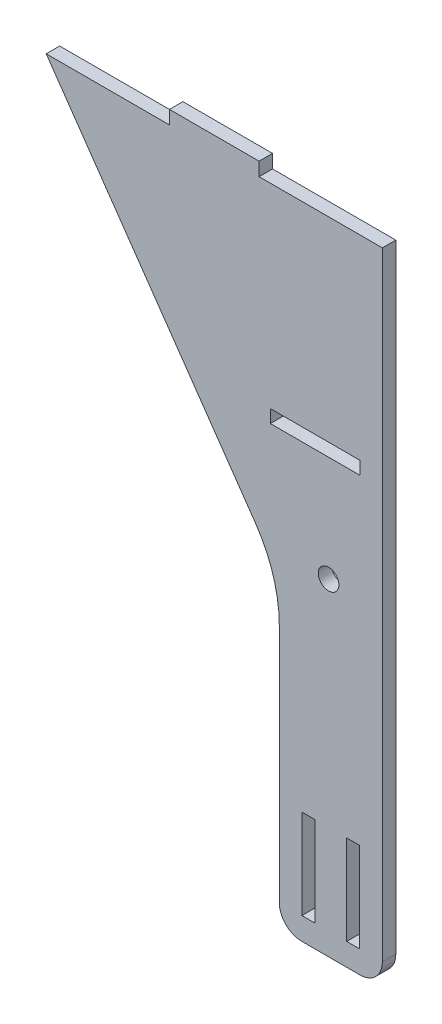
ISO-10303-21;
HEADER;
FILE_DESCRIPTION(('STEP AP214'),'2;1');
FILE_NAME('part.step','',(''),(''),'','','');
FILE_SCHEMA(('AUTOMOTIVE_DESIGN { 1 0 10303 214 1 1 1 1 }'));
ENDSEC;
DATA;
#1=APPLICATION_CONTEXT('core data for automotive mechanical design processes');
#2=APPLICATION_PROTOCOL_DEFINITION('international standard','automotive_design',2000,#1);
#3=PRODUCT_CONTEXT('',#1,'mechanical');
#4=PRODUCT('Part','Part','',(#3));
#5=PRODUCT_RELATED_PRODUCT_CATEGORY('part','',(#4));
#6=PRODUCT_DEFINITION_FORMATION('','',#4);
#7=PRODUCT_DEFINITION_CONTEXT('part definition',#1,'design');
#8=PRODUCT_DEFINITION('design','',#6,#7);
#9=PRODUCT_DEFINITION_SHAPE('','',#8);
#10=(LENGTH_UNIT() NAMED_UNIT(*) SI_UNIT(.MILLI.,.METRE.));
#11=(NAMED_UNIT(*) PLANE_ANGLE_UNIT() SI_UNIT($,.RADIAN.));
#12=(NAMED_UNIT(*) SI_UNIT($,.STERADIAN.) SOLID_ANGLE_UNIT());
#13=UNCERTAINTY_MEASURE_WITH_UNIT(LENGTH_MEASURE(1.E-05),#10,'distance_accuracy_value','');
#14=(GEOMETRIC_REPRESENTATION_CONTEXT(3) GLOBAL_UNCERTAINTY_ASSIGNED_CONTEXT((#13)) GLOBAL_UNIT_ASSIGNED_CONTEXT((#10,
#11,#12)) REPRESENTATION_CONTEXT('',''));
#15=CARTESIAN_POINT('',(0.,0.,0.));
#16=DIRECTION('',(0.,0.,1.));
#17=DIRECTION('',(1.,0.,0.));
#18=AXIS2_PLACEMENT_3D('',#15,#16,#17);
#19=CARTESIAN_POINT('',(0.,0.,3.));
#20=DIRECTION('',(0.,0.,1.));
#21=DIRECTION('',(1.,0.,0.));
#22=AXIS2_PLACEMENT_3D('',#19,#20,#21);
#23=PLANE('',#22);
#24=DIRECTION('',(0.,-1.,0.));
#25=VECTOR('',#24,1.);
#26=CARTESIAN_POINT('',(-5.,99.45,3.));
#27=LINE('',#26,#25);
#28=CARTESIAN_POINT('',(-5.,99.45,3.));
#29=VERTEX_POINT('',#28);
#30=CARTESIAN_POINT('',(-5.,96.55,3.));
#31=VERTEX_POINT('',#30);
#32=EDGE_CURVE('E195',#29,#31,#27,.T.);
#33=ORIENTED_EDGE('',*,*,#32,.T.);
#34=DIRECTION('',(-1.,0.,0.));
#35=VECTOR('',#34,1.);
#36=CARTESIAN_POINT('',(-5.,96.55,3.));
#37=LINE('',#36,#35);
#38=CARTESIAN_POINT('',(-25.,96.55,3.));
#39=VERTEX_POINT('',#38);
#40=EDGE_CURVE('E204',#31,#39,#37,.T.);
#41=ORIENTED_EDGE('',*,*,#40,.T.);
#42=DIRECTION('',(0.,1.,0.));
#43=VECTOR('',#42,1.);
#44=CARTESIAN_POINT('',(-25.,99.45,3.));
#45=LINE('',#44,#43);
#46=CARTESIAN_POINT('',(-25.,99.45,3.));
#47=VERTEX_POINT('',#46);
#48=EDGE_CURVE('E48',#39,#47,#45,.T.);
#49=ORIENTED_EDGE('',*,*,#48,.T.);
#50=DIRECTION('',(1.,0.,0.));
#51=VECTOR('',#50,1.);
#52=CARTESIAN_POINT('',(-5.,99.45,3.));
#53=LINE('',#52,#51);
#54=EDGE_CURVE('E201',#47,#29,#53,.T.);
#55=ORIENTED_EDGE('',*,*,#54,.T.);
#56=EDGE_LOOP('',(#33,#41,#49,#55));
#57=FACE_BOUND('',#56,.T.);
#58=CARTESIAN_POINT('',(-12.0000000000026,73.,3.));
#59=DIRECTION('',(0.,0.,1.));
#60=DIRECTION('',(1.,0.,0.));
#61=AXIS2_PLACEMENT_3D('',#58,#59,#60);
#62=CIRCLE('',#61,2.3);
#63=CARTESIAN_POINT('',(-9.70000000000261,73.,3.));
#64=VERTEX_POINT('',#63);
#65=EDGE_CURVE('E225',#64,#64,#62,.T.);
#66=ORIENTED_EDGE('',*,*,#65,.F.);
#67=EDGE_LOOP('',(#66));
#68=FACE_BOUND('',#67,.T.);
#69=DIRECTION('',(1.,0.,0.));
#70=VECTOR('',#69,1.);
#71=CARTESIAN_POINT('',(-17.95,4.99999999999994,3.));
#72=LINE('',#71,#70);
#73=CARTESIAN_POINT('',(-17.95,4.99999999999994,3.));
#74=VERTEX_POINT('',#73);
#75=CARTESIAN_POINT('',(-15.05,4.99999999999994,3.));
#76=VERTEX_POINT('',#75);
#77=EDGE_CURVE('E265',#74,#76,#72,.T.);
#78=ORIENTED_EDGE('',*,*,#77,.F.);
#79=DIRECTION('',(0.,-1.,0.));
#80=VECTOR('',#79,1.);
#81=CARTESIAN_POINT('',(-17.95,24.9999999999999,3.));
#82=LINE('',#81,#80);
#83=CARTESIAN_POINT('',(-17.95,24.9999999999999,3.));
#84=VERTEX_POINT('',#83);
#85=EDGE_CURVE('E263',#84,#74,#82,.T.);
#86=ORIENTED_EDGE('',*,*,#85,.F.);
#87=DIRECTION('',(-1.,0.,0.));
#88=VECTOR('',#87,1.);
#89=CARTESIAN_POINT('',(-17.95,24.9999999999999,3.));
#90=LINE('',#89,#88);
#91=CARTESIAN_POINT('',(-15.05,24.9999999999999,3.));
#92=VERTEX_POINT('',#91);
#93=EDGE_CURVE('E271',#92,#84,#90,.T.);
#94=ORIENTED_EDGE('',*,*,#93,.F.);
#95=DIRECTION('',(0.,1.,0.));
#96=VECTOR('',#95,1.);
#97=CARTESIAN_POINT('',(-15.05,24.9999999999999,3.));
#98=LINE('',#97,#96);
#99=EDGE_CURVE('E268',#76,#92,#98,.T.);
#100=ORIENTED_EDGE('',*,*,#99,.F.);
#101=EDGE_LOOP('',(#78,#86,#94,#100));
#102=FACE_BOUND('',#101,.T.);
#103=DIRECTION('',(1.,0.,0.));
#104=VECTOR('',#103,1.);
#105=CARTESIAN_POINT('',(0.,0.,3.));
#106=LINE('',#105,#104);
#107=CARTESIAN_POINT('',(-18.,0.,3.));
#108=VERTEX_POINT('',#107);
#109=CARTESIAN_POINT('',(-5.,0.,3.));
#110=VERTEX_POINT('',#109);
#111=EDGE_CURVE('E312',#108,#110,#106,.T.);
#112=ORIENTED_EDGE('',*,*,#111,.T.);
#113=CARTESIAN_POINT('',(-5.,5.,3.));
#114=DIRECTION('',(0.,0.,1.));
#115=DIRECTION('',(1.,0.,0.));
#116=AXIS2_PLACEMENT_3D('',#113,#114,#115);
#117=CIRCLE('',#116,5.);
#118=CARTESIAN_POINT('',(0.,5.,3.));
#119=VERTEX_POINT('',#118);
#120=EDGE_CURVE('E366',#110,#119,#117,.T.);
#121=ORIENTED_EDGE('',*,*,#120,.T.);
#122=DIRECTION('',(0.,1.,0.));
#123=VECTOR('',#122,1.);
#124=CARTESIAN_POINT('',(0.,0.,3.));
#125=LINE('',#124,#123);
#126=CARTESIAN_POINT('',(0.,143.,3.));
#127=VERTEX_POINT('',#126);
#128=EDGE_CURVE('E294',#119,#127,#125,.T.);
#129=ORIENTED_EDGE('',*,*,#128,.T.);
#130=DIRECTION('',(-1.,0.,0.));
#131=VECTOR('',#130,1.);
#132=CARTESIAN_POINT('',(0.,143.,3.));
#133=LINE('',#132,#131);
#134=CARTESIAN_POINT('',(-27.5,143.,3.));
#135=VERTEX_POINT('',#134);
#136=EDGE_CURVE('E296',#127,#135,#133,.T.);
#137=ORIENTED_EDGE('',*,*,#136,.T.);
#138=DIRECTION('',(0.,1.,0.));
#139=VECTOR('',#138,1.);
#140=CARTESIAN_POINT('',(-27.5,143.,3.));
#141=LINE('',#140,#139);
#142=CARTESIAN_POINT('',(-27.5,146.,3.));
#143=VERTEX_POINT('',#142);
#144=EDGE_CURVE('E299',#135,#143,#141,.T.);
#145=ORIENTED_EDGE('',*,*,#144,.T.);
#146=DIRECTION('',(-1.,0.,0.));
#147=VECTOR('',#146,1.);
#148=CARTESIAN_POINT('',(-47.5,146.,3.));
#149=LINE('',#148,#147);
#150=CARTESIAN_POINT('',(-47.5,146.,3.));
#151=VERTEX_POINT('',#150);
#152=EDGE_CURVE('E301',#143,#151,#149,.T.);
#153=ORIENTED_EDGE('',*,*,#152,.T.);
#154=DIRECTION('',(0.,-1.,0.));
#155=VECTOR('',#154,1.);
#156=CARTESIAN_POINT('',(-47.5,143.,3.));
#157=LINE('',#156,#155);
#158=CARTESIAN_POINT('',(-47.5,143.,3.));
#159=VERTEX_POINT('',#158);
#160=EDGE_CURVE('E303',#151,#159,#157,.T.);
#161=ORIENTED_EDGE('',*,*,#160,.T.);
#162=DIRECTION('',(-1.,0.,0.));
#163=VECTOR('',#162,1.);
#164=CARTESIAN_POINT('',(-75.,143.,3.));
#165=LINE('',#164,#163);
#166=CARTESIAN_POINT('',(-75.,143.,3.));
#167=VERTEX_POINT('',#166);
#168=EDGE_CURVE('E305',#159,#167,#165,.T.);
#169=ORIENTED_EDGE('',*,*,#168,.T.);
#170=DIRECTION('',(0.569779621770593,-0.821797531399894,0.));
#171=VECTOR('',#170,1.);
#172=CARTESIAN_POINT('',(-23.,68.,3.));
#173=LINE('',#172,#171);
#174=CARTESIAN_POINT('',(-28.3460740580032,75.7106837375046,3.));
#175=VERTEX_POINT('',#174);
#176=EDGE_CURVE('E307',#167,#175,#173,.T.);
#177=ORIENTED_EDGE('',*,*,#176,.T.);
#178=CARTESIAN_POINT('',(-53.,58.6172950843868,3.));
#179=DIRECTION('',(0.,0.,1.));
#180=DIRECTION('',(1.,0.,0.));
#181=AXIS2_PLACEMENT_3D('',#178,#179,#180);
#182=CIRCLE('',#181,30.);
#183=CARTESIAN_POINT('',(-23.,58.6172950843868,3.));
#184=VERTEX_POINT('',#183);
#185=EDGE_CURVE('E11',#175,#184,#182,.F.);
#186=ORIENTED_EDGE('',*,*,#185,.T.);
#187=DIRECTION('',(0.,-1.,0.));
#188=VECTOR('',#187,1.);
#189=CARTESIAN_POINT('',(-23.,0.,3.));
#190=LINE('',#189,#188);
#191=CARTESIAN_POINT('',(-23.,5.,3.));
#192=VERTEX_POINT('',#191);
#193=EDGE_CURVE('E310',#184,#192,#190,.T.);
#194=ORIENTED_EDGE('',*,*,#193,.T.);
#195=CARTESIAN_POINT('',(-18.,5.,3.));
#196=DIRECTION('',(0.,0.,1.));
#197=DIRECTION('',(1.,0.,0.));
#198=AXIS2_PLACEMENT_3D('',#195,#196,#197);
#199=CIRCLE('',#198,5.);
#200=EDGE_CURVE('E364',#192,#108,#199,.T.);
#201=ORIENTED_EDGE('',*,*,#200,.T.);
#202=EDGE_LOOP('',(#112,#121,#129,#137,#145,#153,#161,#169,#177,#186,#194,#201));
#203=FACE_BOUND('',#202,.T.);
#204=DIRECTION('',(1.,0.,0.));
#205=VECTOR('',#204,1.);
#206=CARTESIAN_POINT('',(-7.94999999999999,4.99999999999994,3.));
#207=LINE('',#206,#205);
#208=CARTESIAN_POINT('',(-7.94999999999999,4.99999999999994,3.));
#209=VERTEX_POINT('',#208);
#210=CARTESIAN_POINT('',(-5.04999999999999,4.99999999999994,3.));
#211=VERTEX_POINT('',#210);
#212=EDGE_CURVE('E233',#209,#211,#207,.T.);
#213=ORIENTED_EDGE('',*,*,#212,.F.);
#214=DIRECTION('',(0.,-1.,0.));
#215=VECTOR('',#214,1.);
#216=CARTESIAN_POINT('',(-7.94999999999999,4.99999999999994,3.));
#217=LINE('',#216,#215);
#218=CARTESIAN_POINT('',(-7.94999999999999,24.9999999999999,3.));
#219=VERTEX_POINT('',#218);
#220=EDGE_CURVE('E231',#219,#209,#217,.T.);
#221=ORIENTED_EDGE('',*,*,#220,.F.);
#222=DIRECTION('',(-1.,0.,0.));
#223=VECTOR('',#222,1.);
#224=CARTESIAN_POINT('',(-7.94999999999999,24.9999999999999,3.));
#225=LINE('',#224,#223);
#226=CARTESIAN_POINT('',(-5.05,24.9999999999999,3.));
#227=VERTEX_POINT('',#226);
#228=EDGE_CURVE('E239',#227,#219,#225,.T.);
#229=ORIENTED_EDGE('',*,*,#228,.F.);
#230=DIRECTION('',(0.,1.,0.));
#231=VECTOR('',#230,1.);
#232=CARTESIAN_POINT('',(-5.04999999999999,4.99999999999994,3.));
#233=LINE('',#232,#231);
#234=EDGE_CURVE('E236',#211,#227,#233,.T.);
#235=ORIENTED_EDGE('',*,*,#234,.F.);
#236=EDGE_LOOP('',(#213,#221,#229,#235));
#237=FACE_BOUND('',#236,.T.);
#238=ADVANCED_FACE('F32',(#57,#68,#102,#203,#237),#23,.T.);
#239=CARTESIAN_POINT('',(0.,0.,0.));
#240=DIRECTION('',(0.,0.,1.));
#241=DIRECTION('',(1.,0.,0.));
#242=AXIS2_PLACEMENT_3D('',#239,#240,#241);
#243=PLANE('',#242);
#244=DIRECTION('',(-1.,0.,0.));
#245=VECTOR('',#244,1.);
#246=CARTESIAN_POINT('',(-5.,96.55,0.));
#247=LINE('',#246,#245);
#248=CARTESIAN_POINT('',(-5.,96.55,0.));
#249=VERTEX_POINT('',#248);
#250=CARTESIAN_POINT('',(-25.,96.55,0.));
#251=VERTEX_POINT('',#250);
#252=EDGE_CURVE('E219',#249,#251,#247,.T.);
#253=ORIENTED_EDGE('',*,*,#252,.F.);
#254=DIRECTION('',(0.,-1.,0.));
#255=VECTOR('',#254,1.);
#256=CARTESIAN_POINT('',(-5.,99.45,0.));
#257=LINE('',#256,#255);
#258=CARTESIAN_POINT('',(-5.,99.45,0.));
#259=VERTEX_POINT('',#258);
#260=EDGE_CURVE('E56',#259,#249,#257,.T.);
#261=ORIENTED_EDGE('',*,*,#260,.F.);
#262=DIRECTION('',(1.,0.,0.));
#263=VECTOR('',#262,1.);
#264=CARTESIAN_POINT('',(-5.,99.45,0.));
#265=LINE('',#264,#263);
#266=CARTESIAN_POINT('',(-25.,99.45,0.));
#267=VERTEX_POINT('',#266);
#268=EDGE_CURVE('E210',#267,#259,#265,.T.);
#269=ORIENTED_EDGE('',*,*,#268,.F.);
#270=DIRECTION('',(0.,1.,0.));
#271=VECTOR('',#270,1.);
#272=CARTESIAN_POINT('',(-25.,99.45,0.));
#273=LINE('',#272,#271);
#274=EDGE_CURVE('E213',#251,#267,#273,.T.);
#275=ORIENTED_EDGE('',*,*,#274,.F.);
#276=EDGE_LOOP('',(#253,#261,#269,#275));
#277=FACE_BOUND('',#276,.T.);
#278=CARTESIAN_POINT('',(-12.0000000000026,73.,0.));
#279=DIRECTION('',(0.,0.,1.));
#280=DIRECTION('',(1.,0.,0.));
#281=AXIS2_PLACEMENT_3D('',#278,#279,#280);
#282=CIRCLE('',#281,2.3);
#283=CARTESIAN_POINT('',(-9.70000000000261,73.,0.));
#284=VERTEX_POINT('',#283);
#285=EDGE_CURVE('E36',#284,#284,#282,.T.);
#286=ORIENTED_EDGE('',*,*,#285,.T.);
#287=EDGE_LOOP('',(#286));
#288=FACE_BOUND('',#287,.T.);
#289=DIRECTION('',(0.,-1.,0.));
#290=VECTOR('',#289,1.);
#291=CARTESIAN_POINT('',(-17.95,24.9999999999999,0.));
#292=LINE('',#291,#290);
#293=CARTESIAN_POINT('',(-17.95,24.9999999999999,0.));
#294=VERTEX_POINT('',#293);
#295=CARTESIAN_POINT('',(-17.95,4.99999999999994,0.));
#296=VERTEX_POINT('',#295);
#297=EDGE_CURVE('E262',#294,#296,#292,.T.);
#298=ORIENTED_EDGE('',*,*,#297,.T.);
#299=DIRECTION('',(1.,0.,0.));
#300=VECTOR('',#299,1.);
#301=CARTESIAN_POINT('',(-17.95,4.99999999999994,0.));
#302=LINE('',#301,#300);
#303=CARTESIAN_POINT('',(-15.05,4.99999999999994,0.));
#304=VERTEX_POINT('',#303);
#305=EDGE_CURVE('E276',#296,#304,#302,.T.);
#306=ORIENTED_EDGE('',*,*,#305,.T.);
#307=DIRECTION('',(0.,1.,0.));
#308=VECTOR('',#307,1.);
#309=CARTESIAN_POINT('',(-15.05,24.9999999999999,0.));
#310=LINE('',#309,#308);
#311=CARTESIAN_POINT('',(-15.05,24.9999999999999,0.));
#312=VERTEX_POINT('',#311);
#313=EDGE_CURVE('E279',#304,#312,#310,.T.);
#314=ORIENTED_EDGE('',*,*,#313,.T.);
#315=DIRECTION('',(-1.,0.,0.));
#316=VECTOR('',#315,1.);
#317=CARTESIAN_POINT('',(-17.95,24.9999999999999,0.));
#318=LINE('',#317,#316);
#319=EDGE_CURVE('E266',#312,#294,#318,.T.);
#320=ORIENTED_EDGE('',*,*,#319,.T.);
#321=EDGE_LOOP('',(#298,#306,#314,#320));
#322=FACE_BOUND('',#321,.T.);
#323=DIRECTION('',(0.,1.,0.));
#324=VECTOR('',#323,1.);
#325=CARTESIAN_POINT('',(0.,0.,0.));
#326=LINE('',#325,#324);
#327=CARTESIAN_POINT('',(0.,5.,0.));
#328=VERTEX_POINT('',#327);
#329=CARTESIAN_POINT('',(0.,143.,0.));
#330=VERTEX_POINT('',#329);
#331=EDGE_CURVE('E293',#328,#330,#326,.T.);
#332=ORIENTED_EDGE('',*,*,#331,.F.);
#333=CARTESIAN_POINT('',(-5.,5.,0.));
#334=DIRECTION('',(0.,0.,1.));
#335=DIRECTION('',(1.,0.,0.));
#336=AXIS2_PLACEMENT_3D('',#333,#334,#335);
#337=CIRCLE('',#336,5.);
#338=CARTESIAN_POINT('',(-5.,0.,0.));
#339=VERTEX_POINT('',#338);
#340=EDGE_CURVE('E357',#328,#339,#337,.F.);
#341=ORIENTED_EDGE('',*,*,#340,.T.);
#342=DIRECTION('',(1.,0.,0.));
#343=VECTOR('',#342,1.);
#344=CARTESIAN_POINT('',(0.,0.,0.));
#345=LINE('',#344,#343);
#346=CARTESIAN_POINT('',(-18.,0.,0.));
#347=VERTEX_POINT('',#346);
#348=EDGE_CURVE('E297',#347,#339,#345,.T.);
#349=ORIENTED_EDGE('',*,*,#348,.F.);
#350=CARTESIAN_POINT('',(-18.,5.,0.));
#351=DIRECTION('',(0.,0.,1.));
#352=DIRECTION('',(1.,0.,0.));
#353=AXIS2_PLACEMENT_3D('',#350,#351,#352);
#354=CIRCLE('',#353,5.);
#355=CARTESIAN_POINT('',(-23.,5.,0.));
#356=VERTEX_POINT('',#355);
#357=EDGE_CURVE('E354',#347,#356,#354,.F.);
#358=ORIENTED_EDGE('',*,*,#357,.T.);
#359=DIRECTION('',(0.,-1.,0.));
#360=VECTOR('',#359,1.);
#361=CARTESIAN_POINT('',(-23.,0.,0.));
#362=LINE('',#361,#360);
#363=CARTESIAN_POINT('',(-23.,58.6172950843868,0.));
#364=VERTEX_POINT('',#363);
#365=EDGE_CURVE('E330',#364,#356,#362,.T.);
#366=ORIENTED_EDGE('',*,*,#365,.F.);
#367=CARTESIAN_POINT('',(-53.,58.6172950843868,0.));
#368=DIRECTION('',(0.,0.,1.));
#369=DIRECTION('',(1.,0.,0.));
#370=AXIS2_PLACEMENT_3D('',#367,#368,#369);
#371=CIRCLE('',#370,30.);
#372=CARTESIAN_POINT('',(-28.3460740580032,75.7106837375046,0.));
#373=VERTEX_POINT('',#372);
#374=EDGE_CURVE('E41',#364,#373,#371,.T.);
#375=ORIENTED_EDGE('',*,*,#374,.T.);
#376=DIRECTION('',(0.569779621770593,-0.821797531399894,0.));
#377=VECTOR('',#376,1.);
#378=CARTESIAN_POINT('',(-23.,68.,0.));
#379=LINE('',#378,#377);
#380=CARTESIAN_POINT('',(-75.,143.,0.));
#381=VERTEX_POINT('',#380);
#382=EDGE_CURVE('E327',#381,#373,#379,.T.);
#383=ORIENTED_EDGE('',*,*,#382,.F.);
#384=DIRECTION('',(-1.,0.,0.));
#385=VECTOR('',#384,1.);
#386=CARTESIAN_POINT('',(-75.,143.,0.));
#387=LINE('',#386,#385);
#388=CARTESIAN_POINT('',(-47.5,143.,0.));
#389=VERTEX_POINT('',#388);
#390=EDGE_CURVE('E325',#389,#381,#387,.T.);
#391=ORIENTED_EDGE('',*,*,#390,.F.);
#392=DIRECTION('',(0.,-1.,0.));
#393=VECTOR('',#392,1.);
#394=CARTESIAN_POINT('',(-47.5,143.,0.));
#395=LINE('',#394,#393);
#396=CARTESIAN_POINT('',(-47.5,146.,0.));
#397=VERTEX_POINT('',#396);
#398=EDGE_CURVE('E323',#397,#389,#395,.T.);
#399=ORIENTED_EDGE('',*,*,#398,.F.);
#400=DIRECTION('',(-1.,0.,0.));
#401=VECTOR('',#400,1.);
#402=CARTESIAN_POINT('',(-47.5,146.,0.));
#403=LINE('',#402,#401);
#404=CARTESIAN_POINT('',(-27.5,146.,0.));
#405=VERTEX_POINT('',#404);
#406=EDGE_CURVE('E321',#405,#397,#403,.T.);
#407=ORIENTED_EDGE('',*,*,#406,.F.);
#408=DIRECTION('',(0.,1.,0.));
#409=VECTOR('',#408,1.);
#410=CARTESIAN_POINT('',(-27.5,143.,0.));
#411=LINE('',#410,#409);
#412=CARTESIAN_POINT('',(-27.5,143.,0.));
#413=VERTEX_POINT('',#412);
#414=EDGE_CURVE('E319',#413,#405,#411,.T.);
#415=ORIENTED_EDGE('',*,*,#414,.F.);
#416=DIRECTION('',(-1.,0.,0.));
#417=VECTOR('',#416,1.);
#418=CARTESIAN_POINT('',(0.,143.,0.));
#419=LINE('',#418,#417);
#420=EDGE_CURVE('E317',#330,#413,#419,.T.);
#421=ORIENTED_EDGE('',*,*,#420,.F.);
#422=EDGE_LOOP('',(#332,#341,#349,#358,#366,#375,#383,#391,#399,#407,#415,#421));
#423=FACE_BOUND('',#422,.T.);
#424=DIRECTION('',(0.,-1.,0.));
#425=VECTOR('',#424,1.);
#426=CARTESIAN_POINT('',(-7.94999999999999,4.99999999999994,0.));
#427=LINE('',#426,#425);
#428=CARTESIAN_POINT('',(-7.94999999999999,24.9999999999999,0.));
#429=VERTEX_POINT('',#428);
#430=CARTESIAN_POINT('',(-7.94999999999999,4.99999999999994,0.));
#431=VERTEX_POINT('',#430);
#432=EDGE_CURVE('E242',#429,#431,#427,.T.);
#433=ORIENTED_EDGE('',*,*,#432,.T.);
#434=DIRECTION('',(1.,0.,0.));
#435=VECTOR('',#434,1.);
#436=CARTESIAN_POINT('',(-7.94999999999999,4.99999999999994,0.));
#437=LINE('',#436,#435);
#438=CARTESIAN_POINT('',(-5.04999999999999,4.99999999999994,0.));
#439=VERTEX_POINT('',#438);
#440=EDGE_CURVE('E245',#431,#439,#437,.T.);
#441=ORIENTED_EDGE('',*,*,#440,.T.);
#442=DIRECTION('',(0.,1.,0.));
#443=VECTOR('',#442,1.);
#444=CARTESIAN_POINT('',(-5.04999999999999,4.99999999999994,0.));
#445=LINE('',#444,#443);
#446=CARTESIAN_POINT('',(-5.05,24.9999999999999,0.));
#447=VERTEX_POINT('',#446);
#448=EDGE_CURVE('E248',#439,#447,#445,.T.);
#449=ORIENTED_EDGE('',*,*,#448,.T.);
#450=DIRECTION('',(-1.,0.,0.));
#451=VECTOR('',#450,1.);
#452=CARTESIAN_POINT('',(-7.94999999999999,24.9999999999999,0.));
#453=LINE('',#452,#451);
#454=EDGE_CURVE('E234',#447,#429,#453,.T.);
#455=ORIENTED_EDGE('',*,*,#454,.T.);
#456=EDGE_LOOP('',(#433,#441,#449,#455));
#457=FACE_BOUND('',#456,.T.);
#458=ADVANCED_FACE('F380',(#277,#288,#322,#423,#457),#243,.F.);
#459=CARTESIAN_POINT('',(0.,0.,3.));
#460=DIRECTION('',(-1.,0.,0.));
#461=DIRECTION('',(0.,0.,1.));
#462=AXIS2_PLACEMENT_3D('',#459,#460,#461);
#463=PLANE('',#462);
#464=ORIENTED_EDGE('',*,*,#128,.F.);
#465=DIRECTION('',(0.,0.,-1.));
#466=VECTOR('',#465,1.);
#467=CARTESIAN_POINT('',(0.,5.,3.));
#468=LINE('',#467,#466);
#469=EDGE_CURVE('E351',#119,#328,#468,.T.);
#470=ORIENTED_EDGE('',*,*,#469,.T.);
#471=ORIENTED_EDGE('',*,*,#331,.T.);
#472=DIRECTION('',(0.,0.,-1.));
#473=VECTOR('',#472,1.);
#474=CARTESIAN_POINT('',(0.,143.,3.));
#475=LINE('',#474,#473);
#476=EDGE_CURVE('E348',#127,#330,#475,.T.);
#477=ORIENTED_EDGE('',*,*,#476,.F.);
#478=EDGE_LOOP('',(#464,#470,#471,#477));
#479=FACE_BOUND('',#478,.T.);
#480=ADVANCED_FACE('F414',(#479),#463,.F.);
#481=CARTESIAN_POINT('',(0.,143.,3.));
#482=DIRECTION('',(0.,-1.,0.));
#483=DIRECTION('',(0.,0.,-1.));
#484=AXIS2_PLACEMENT_3D('',#481,#482,#483);
#485=PLANE('',#484);
#486=ORIENTED_EDGE('',*,*,#420,.T.);
#487=DIRECTION('',(0.,0.,-1.));
#488=VECTOR('',#487,1.);
#489=CARTESIAN_POINT('',(-27.5,143.,3.));
#490=LINE('',#489,#488);
#491=EDGE_CURVE('E345',#135,#413,#490,.T.);
#492=ORIENTED_EDGE('',*,*,#491,.F.);
#493=ORIENTED_EDGE('',*,*,#136,.F.);
#494=ORIENTED_EDGE('',*,*,#476,.T.);
#495=EDGE_LOOP('',(#486,#492,#493,#494));
#496=FACE_BOUND('',#495,.T.);
#497=ADVANCED_FACE('F417',(#496),#485,.F.);
#498=CARTESIAN_POINT('',(-27.5,143.,3.));
#499=DIRECTION('',(-1.,0.,0.));
#500=DIRECTION('',(0.,0.,1.));
#501=AXIS2_PLACEMENT_3D('',#498,#499,#500);
#502=PLANE('',#501);
#503=ORIENTED_EDGE('',*,*,#414,.T.);
#504=DIRECTION('',(0.,0.,-1.));
#505=VECTOR('',#504,1.);
#506=CARTESIAN_POINT('',(-27.5,146.,3.));
#507=LINE('',#506,#505);
#508=EDGE_CURVE('E342',#143,#405,#507,.T.);
#509=ORIENTED_EDGE('',*,*,#508,.F.);
#510=ORIENTED_EDGE('',*,*,#144,.F.);
#511=ORIENTED_EDGE('',*,*,#491,.T.);
#512=EDGE_LOOP('',(#503,#509,#510,#511));
#513=FACE_BOUND('',#512,.T.);
#514=ADVANCED_FACE('F424',(#513),#502,.F.);
#515=CARTESIAN_POINT('',(-47.5,146.,3.));
#516=DIRECTION('',(0.,-1.,0.));
#517=DIRECTION('',(0.,0.,-1.));
#518=AXIS2_PLACEMENT_3D('',#515,#516,#517);
#519=PLANE('',#518);
#520=ORIENTED_EDGE('',*,*,#406,.T.);
#521=DIRECTION('',(0.,0.,-1.));
#522=VECTOR('',#521,1.);
#523=CARTESIAN_POINT('',(-47.5,146.,3.));
#524=LINE('',#523,#522);
#525=EDGE_CURVE('E339',#151,#397,#524,.T.);
#526=ORIENTED_EDGE('',*,*,#525,.F.);
#527=ORIENTED_EDGE('',*,*,#152,.F.);
#528=ORIENTED_EDGE('',*,*,#508,.T.);
#529=EDGE_LOOP('',(#520,#526,#527,#528));
#530=FACE_BOUND('',#529,.T.);
#531=ADVANCED_FACE('F428',(#530),#519,.F.);
#532=CARTESIAN_POINT('',(-47.5,143.,3.));
#533=DIRECTION('',(1.,0.,0.));
#534=DIRECTION('',(0.,0.,-1.));
#535=AXIS2_PLACEMENT_3D('',#532,#533,#534);
#536=PLANE('',#535);
#537=ORIENTED_EDGE('',*,*,#398,.T.);
#538=DIRECTION('',(0.,0.,-1.));
#539=VECTOR('',#538,1.);
#540=CARTESIAN_POINT('',(-47.5,143.,3.));
#541=LINE('',#540,#539);
#542=EDGE_CURVE('E336',#159,#389,#541,.T.);
#543=ORIENTED_EDGE('',*,*,#542,.F.);
#544=ORIENTED_EDGE('',*,*,#160,.F.);
#545=ORIENTED_EDGE('',*,*,#525,.T.);
#546=EDGE_LOOP('',(#537,#543,#544,#545));
#547=FACE_BOUND('',#546,.T.);
#548=ADVANCED_FACE('F433',(#547),#536,.F.);
#549=CARTESIAN_POINT('',(-75.,143.,3.));
#550=DIRECTION('',(0.,-1.,0.));
#551=DIRECTION('',(0.,0.,-1.));
#552=AXIS2_PLACEMENT_3D('',#549,#550,#551);
#553=PLANE('',#552);
#554=ORIENTED_EDGE('',*,*,#390,.T.);
#555=DIRECTION('',(0.,0.,-1.));
#556=VECTOR('',#555,1.);
#557=CARTESIAN_POINT('',(-75.,143.,3.));
#558=LINE('',#557,#556);
#559=EDGE_CURVE('E315',#167,#381,#558,.T.);
#560=ORIENTED_EDGE('',*,*,#559,.F.);
#561=ORIENTED_EDGE('',*,*,#168,.F.);
#562=ORIENTED_EDGE('',*,*,#542,.T.);
#563=EDGE_LOOP('',(#554,#560,#561,#562));
#564=FACE_BOUND('',#563,.T.);
#565=ADVANCED_FACE('F436',(#564),#553,.F.);
#566=CARTESIAN_POINT('',(-23.,68.,3.));
#567=DIRECTION('',(0.821797531399894,0.569779621770593,0.));
#568=DIRECTION('',(-0.569779621770593,0.821797531399894,0.));
#569=AXIS2_PLACEMENT_3D('',#566,#567,#568);
#570=PLANE('',#569);
#571=ORIENTED_EDGE('',*,*,#382,.T.);
#572=DIRECTION('',(0.,0.,-1.));
#573=VECTOR('',#572,1.);
#574=CARTESIAN_POINT('',(-28.3460740580032,75.7106837375046,3.));
#575=LINE('',#574,#573);
#576=EDGE_CURVE('E374',#373,#175,#575,.F.);
#577=ORIENTED_EDGE('',*,*,#576,.T.);
#578=ORIENTED_EDGE('',*,*,#176,.F.);
#579=ORIENTED_EDGE('',*,*,#559,.T.);
#580=EDGE_LOOP('',(#571,#577,#578,#579));
#581=FACE_BOUND('',#580,.T.);
#582=ADVANCED_FACE('F387',(#581),#570,.F.);
#583=CARTESIAN_POINT('',(-23.,0.,3.));
#584=DIRECTION('',(1.,0.,0.));
#585=DIRECTION('',(0.,0.,-1.));
#586=AXIS2_PLACEMENT_3D('',#583,#584,#585);
#587=PLANE('',#586);
#588=ORIENTED_EDGE('',*,*,#193,.F.);
#589=DIRECTION('',(0.,0.,-1.));
#590=VECTOR('',#589,1.);
#591=CARTESIAN_POINT('',(-23.,58.6172950843868,0.));
#592=LINE('',#591,#590);
#593=EDGE_CURVE('E371',#184,#364,#592,.T.);
#594=ORIENTED_EDGE('',*,*,#593,.T.);
#595=ORIENTED_EDGE('',*,*,#365,.T.);
#596=DIRECTION('',(0.,0.,-1.));
#597=VECTOR('',#596,1.);
#598=CARTESIAN_POINT('',(-23.,5.,3.));
#599=LINE('',#598,#597);
#600=EDGE_CURVE('E368',#356,#192,#599,.F.);
#601=ORIENTED_EDGE('',*,*,#600,.T.);
#602=EDGE_LOOP('',(#588,#594,#595,#601));
#603=FACE_BOUND('',#602,.T.);
#604=ADVANCED_FACE('F395',(#603),#587,.F.);
#605=CARTESIAN_POINT('',(0.,0.,3.));
#606=DIRECTION('',(0.,1.,0.));
#607=DIRECTION('',(0.,0.,1.));
#608=AXIS2_PLACEMENT_3D('',#605,#606,#607);
#609=PLANE('',#608);
#610=ORIENTED_EDGE('',*,*,#348,.T.);
#611=DIRECTION('',(0.,0.,-1.));
#612=VECTOR('',#611,1.);
#613=CARTESIAN_POINT('',(-5.,0.,3.));
#614=LINE('',#613,#612);
#615=EDGE_CURVE('E362',#339,#110,#614,.F.);
#616=ORIENTED_EDGE('',*,*,#615,.T.);
#617=ORIENTED_EDGE('',*,*,#111,.F.);
#618=DIRECTION('',(0.,0.,-1.));
#619=VECTOR('',#618,1.);
#620=CARTESIAN_POINT('',(-18.,0.,3.));
#621=LINE('',#620,#619);
#622=EDGE_CURVE('E359',#108,#347,#621,.T.);
#623=ORIENTED_EDGE('',*,*,#622,.T.);
#624=EDGE_LOOP('',(#610,#616,#617,#623));
#625=FACE_BOUND('',#624,.T.);
#626=ADVANCED_FACE('F404',(#625),#609,.F.);
#627=CARTESIAN_POINT('',(-17.95,24.9999999999999,3.));
#628=DIRECTION('',(1.,0.,0.));
#629=DIRECTION('',(0.,1.,0.));
#630=AXIS2_PLACEMENT_3D('',#627,#628,#629);
#631=PLANE('',#630);
#632=ORIENTED_EDGE('',*,*,#297,.F.);
#633=DIRECTION('',(0.,0.,-1.));
#634=VECTOR('',#633,1.);
#635=CARTESIAN_POINT('',(-17.95,24.9999999999999,3.));
#636=LINE('',#635,#634);
#637=EDGE_CURVE('E273',#84,#294,#636,.T.);
#638=ORIENTED_EDGE('',*,*,#637,.F.);
#639=ORIENTED_EDGE('',*,*,#85,.T.);
#640=DIRECTION('',(0.,0.,-1.));
#641=VECTOR('',#640,1.);
#642=CARTESIAN_POINT('',(-17.95,4.99999999999994,3.));
#643=LINE('',#642,#641);
#644=EDGE_CURVE('E290',#74,#296,#643,.T.);
#645=ORIENTED_EDGE('',*,*,#644,.T.);
#646=EDGE_LOOP('',(#632,#638,#639,#645));
#647=FACE_BOUND('',#646,.T.);
#648=ADVANCED_FACE('F453',(#647),#631,.T.);
#649=CARTESIAN_POINT('',(-17.95,4.99999999999994,3.));
#650=DIRECTION('',(0.,1.,0.));
#651=DIRECTION('',(-1.,0.,0.));
#652=AXIS2_PLACEMENT_3D('',#649,#650,#651);
#653=PLANE('',#652);
#654=ORIENTED_EDGE('',*,*,#305,.F.);
#655=ORIENTED_EDGE('',*,*,#644,.F.);
#656=ORIENTED_EDGE('',*,*,#77,.T.);
#657=DIRECTION('',(0.,0.,-1.));
#658=VECTOR('',#657,1.);
#659=CARTESIAN_POINT('',(-15.05,4.99999999999994,3.));
#660=LINE('',#659,#658);
#661=EDGE_CURVE('E288',#76,#304,#660,.T.);
#662=ORIENTED_EDGE('',*,*,#661,.T.);
#663=EDGE_LOOP('',(#654,#655,#656,#662));
#664=FACE_BOUND('',#663,.T.);
#665=ADVANCED_FACE('F476',(#664),#653,.T.);
#666=CARTESIAN_POINT('',(-15.05,24.9999999999999,3.));
#667=DIRECTION('',(-1.,0.,0.));
#668=DIRECTION('',(0.,-1.,0.));
#669=AXIS2_PLACEMENT_3D('',#666,#667,#668);
#670=PLANE('',#669);
#671=ORIENTED_EDGE('',*,*,#313,.F.);
#672=ORIENTED_EDGE('',*,*,#661,.F.);
#673=ORIENTED_EDGE('',*,*,#99,.T.);
#674=DIRECTION('',(0.,0.,-1.));
#675=VECTOR('',#674,1.);
#676=CARTESIAN_POINT('',(-15.05,24.9999999999999,3.));
#677=LINE('',#676,#675);
#678=EDGE_CURVE('E286',#92,#312,#677,.T.);
#679=ORIENTED_EDGE('',*,*,#678,.T.);
#680=EDGE_LOOP('',(#671,#672,#673,#679));
#681=FACE_BOUND('',#680,.T.);
#682=ADVANCED_FACE('F483',(#681),#670,.T.);
#683=CARTESIAN_POINT('',(-17.95,24.9999999999999,3.));
#684=DIRECTION('',(0.,-1.,0.));
#685=DIRECTION('',(1.,0.,0.));
#686=AXIS2_PLACEMENT_3D('',#683,#684,#685);
#687=PLANE('',#686);
#688=ORIENTED_EDGE('',*,*,#319,.F.);
#689=ORIENTED_EDGE('',*,*,#678,.F.);
#690=ORIENTED_EDGE('',*,*,#93,.T.);
#691=ORIENTED_EDGE('',*,*,#637,.T.);
#692=EDGE_LOOP('',(#688,#689,#690,#691));
#693=FACE_BOUND('',#692,.T.);
#694=ADVANCED_FACE('F490',(#693),#687,.T.);
#695=CARTESIAN_POINT('',(-7.94999999999999,4.99999999999994,3.));
#696=DIRECTION('',(1.,0.,0.));
#697=DIRECTION('',(0.,1.,0.));
#698=AXIS2_PLACEMENT_3D('',#695,#696,#697);
#699=PLANE('',#698);
#700=ORIENTED_EDGE('',*,*,#432,.F.);
#701=DIRECTION('',(0.,0.,-1.));
#702=VECTOR('',#701,1.);
#703=CARTESIAN_POINT('',(-7.94999999999999,24.9999999999999,3.));
#704=LINE('',#703,#702);
#705=EDGE_CURVE('E241',#219,#429,#704,.T.);
#706=ORIENTED_EDGE('',*,*,#705,.F.);
#707=ORIENTED_EDGE('',*,*,#220,.T.);
#708=DIRECTION('',(0.,0.,-1.));
#709=VECTOR('',#708,1.);
#710=CARTESIAN_POINT('',(-7.94999999999999,4.99999999999994,3.));
#711=LINE('',#710,#709);
#712=EDGE_CURVE('E259',#209,#431,#711,.T.);
#713=ORIENTED_EDGE('',*,*,#712,.T.);
#714=EDGE_LOOP('',(#700,#706,#707,#713));
#715=FACE_BOUND('',#714,.T.);
#716=ADVANCED_FACE('F498',(#715),#699,.T.);
#717=CARTESIAN_POINT('',(-7.94999999999999,4.99999999999994,3.));
#718=DIRECTION('',(0.,1.,0.));
#719=DIRECTION('',(-1.,0.,0.));
#720=AXIS2_PLACEMENT_3D('',#717,#718,#719);
#721=PLANE('',#720);
#722=ORIENTED_EDGE('',*,*,#440,.F.);
#723=ORIENTED_EDGE('',*,*,#712,.F.);
#724=ORIENTED_EDGE('',*,*,#212,.T.);
#725=DIRECTION('',(0.,0.,-1.));
#726=VECTOR('',#725,1.);
#727=CARTESIAN_POINT('',(-5.04999999999999,4.99999999999994,3.));
#728=LINE('',#727,#726);
#729=EDGE_CURVE('E257',#211,#439,#728,.T.);
#730=ORIENTED_EDGE('',*,*,#729,.T.);
#731=EDGE_LOOP('',(#722,#723,#724,#730));
#732=FACE_BOUND('',#731,.T.);
#733=ADVANCED_FACE('F506',(#732),#721,.T.);
#734=CARTESIAN_POINT('',(-5.04999999999999,4.99999999999994,3.));
#735=DIRECTION('',(-1.,0.,0.));
#736=DIRECTION('',(0.,-1.,0.));
#737=AXIS2_PLACEMENT_3D('',#734,#735,#736);
#738=PLANE('',#737);
#739=ORIENTED_EDGE('',*,*,#448,.F.);
#740=ORIENTED_EDGE('',*,*,#729,.F.);
#741=ORIENTED_EDGE('',*,*,#234,.T.);
#742=DIRECTION('',(0.,0.,-1.));
#743=VECTOR('',#742,1.);
#744=CARTESIAN_POINT('',(-5.05,24.9999999999999,3.));
#745=LINE('',#744,#743);
#746=EDGE_CURVE('E255',#227,#447,#745,.T.);
#747=ORIENTED_EDGE('',*,*,#746,.T.);
#748=EDGE_LOOP('',(#739,#740,#741,#747));
#749=FACE_BOUND('',#748,.T.);
#750=ADVANCED_FACE('F514',(#749),#738,.T.);
#751=CARTESIAN_POINT('',(-7.94999999999999,24.9999999999999,3.));
#752=DIRECTION('',(0.,-1.,0.));
#753=DIRECTION('',(0.,0.,-1.));
#754=AXIS2_PLACEMENT_3D('',#751,#752,#753);
#755=PLANE('',#754);
#756=ORIENTED_EDGE('',*,*,#454,.F.);
#757=ORIENTED_EDGE('',*,*,#746,.F.);
#758=ORIENTED_EDGE('',*,*,#228,.T.);
#759=ORIENTED_EDGE('',*,*,#705,.T.);
#760=EDGE_LOOP('',(#756,#757,#758,#759));
#761=FACE_BOUND('',#760,.T.);
#762=ADVANCED_FACE('F522',(#761),#755,.T.);
#763=CARTESIAN_POINT('',(-5.,5.,3.));
#764=DIRECTION('',(0.,0.,-1.));
#765=DIRECTION('',(-1.,0.,0.));
#766=AXIS2_PLACEMENT_3D('',#763,#764,#765);
#767=CYLINDRICAL_SURFACE('',#766,5.);
#768=ORIENTED_EDGE('',*,*,#120,.F.);
#769=ORIENTED_EDGE('',*,*,#615,.F.);
#770=ORIENTED_EDGE('',*,*,#340,.F.);
#771=ORIENTED_EDGE('',*,*,#469,.F.);
#772=EDGE_LOOP('',(#768,#769,#770,#771));
#773=FACE_BOUND('',#772,.T.);
#774=ADVANCED_FACE('F408',(#773),#767,.T.);
#775=CARTESIAN_POINT('',(-18.,5.,3.));
#776=DIRECTION('',(0.,0.,-1.));
#777=DIRECTION('',(-1.,0.,0.));
#778=AXIS2_PLACEMENT_3D('',#775,#776,#777);
#779=CYLINDRICAL_SURFACE('',#778,5.);
#780=ORIENTED_EDGE('',*,*,#200,.F.);
#781=ORIENTED_EDGE('',*,*,#600,.F.);
#782=ORIENTED_EDGE('',*,*,#357,.F.);
#783=ORIENTED_EDGE('',*,*,#622,.F.);
#784=EDGE_LOOP('',(#780,#781,#782,#783));
#785=FACE_BOUND('',#784,.T.);
#786=ADVANCED_FACE('F400',(#785),#779,.T.);
#787=CARTESIAN_POINT('',(-53.,58.6172950843868,3.));
#788=DIRECTION('',(0.,0.,1.));
#789=DIRECTION('',(1.,0.,0.));
#790=AXIS2_PLACEMENT_3D('',#787,#788,#789);
#791=CYLINDRICAL_SURFACE('',#790,30.);
#792=ORIENTED_EDGE('',*,*,#185,.F.);
#793=ORIENTED_EDGE('',*,*,#576,.F.);
#794=ORIENTED_EDGE('',*,*,#374,.F.);
#795=ORIENTED_EDGE('',*,*,#593,.F.);
#796=EDGE_LOOP('',(#792,#793,#794,#795));
#797=FACE_BOUND('',#796,.T.);
#798=ADVANCED_FACE('F34',(#797),#791,.F.);
#799=CARTESIAN_POINT('',(-12.0000000000026,73.,-7.));
#800=DIRECTION('',(0.,0.,1.));
#801=DIRECTION('',(1.,0.,0.));
#802=AXIS2_PLACEMENT_3D('',#799,#800,#801);
#803=CYLINDRICAL_SURFACE('',#802,2.3);
#804=ORIENTED_EDGE('',*,*,#65,.T.);
#805=EDGE_LOOP('',(#804));
#806=FACE_BOUND('',#805,.T.);
#807=ORIENTED_EDGE('',*,*,#285,.F.);
#808=EDGE_LOOP('',(#807));
#809=FACE_BOUND('',#808,.T.);
#810=ADVANCED_FACE('F546',(#806,#809),#803,.F.);
#811=CARTESIAN_POINT('',(-5.,99.45,3.));
#812=DIRECTION('',(1.,0.,0.));
#813=DIRECTION('',(0.,0.,-1.));
#814=AXIS2_PLACEMENT_3D('',#811,#812,#813);
#815=PLANE('',#814);
#816=ORIENTED_EDGE('',*,*,#260,.T.);
#817=DIRECTION('',(0.,0.,-1.));
#818=VECTOR('',#817,1.);
#819=CARTESIAN_POINT('',(-5.,96.55,3.));
#820=LINE('',#819,#818);
#821=EDGE_CURVE('E191',#31,#249,#820,.T.);
#822=ORIENTED_EDGE('',*,*,#821,.F.);
#823=ORIENTED_EDGE('',*,*,#32,.F.);
#824=DIRECTION('',(0.,0.,-1.));
#825=VECTOR('',#824,1.);
#826=CARTESIAN_POINT('',(-5.,99.45,3.));
#827=LINE('',#826,#825);
#828=EDGE_CURVE('E223',#29,#259,#827,.T.);
#829=ORIENTED_EDGE('',*,*,#828,.T.);
#830=EDGE_LOOP('',(#816,#822,#823,#829));
#831=FACE_BOUND('',#830,.T.);
#832=ADVANCED_FACE('F193',(#831),#815,.F.);
#833=CARTESIAN_POINT('',(-5.,99.45,3.));
#834=DIRECTION('',(0.,1.,0.));
#835=DIRECTION('',(-1.,0.,0.));
#836=AXIS2_PLACEMENT_3D('',#833,#834,#835);
#837=PLANE('',#836);
#838=ORIENTED_EDGE('',*,*,#268,.T.);
#839=ORIENTED_EDGE('',*,*,#828,.F.);
#840=ORIENTED_EDGE('',*,*,#54,.F.);
#841=DIRECTION('',(0.,0.,-1.));
#842=VECTOR('',#841,1.);
#843=CARTESIAN_POINT('',(-25.,99.45,3.));
#844=LINE('',#843,#842);
#845=EDGE_CURVE('E226',#47,#267,#844,.T.);
#846=ORIENTED_EDGE('',*,*,#845,.T.);
#847=EDGE_LOOP('',(#838,#839,#840,#846));
#848=FACE_BOUND('',#847,.T.);
#849=ADVANCED_FACE('F559',(#848),#837,.F.);
#850=CARTESIAN_POINT('',(-25.,99.45,3.));
#851=DIRECTION('',(-1.,0.,0.));
#852=DIRECTION('',(0.,0.,1.));
#853=AXIS2_PLACEMENT_3D('',#850,#851,#852);
#854=PLANE('',#853);
#855=ORIENTED_EDGE('',*,*,#274,.T.);
#856=ORIENTED_EDGE('',*,*,#845,.F.);
#857=ORIENTED_EDGE('',*,*,#48,.F.);
#858=DIRECTION('',(0.,0.,-1.));
#859=VECTOR('',#858,1.);
#860=CARTESIAN_POINT('',(-25.,96.55,3.));
#861=LINE('',#860,#859);
#862=EDGE_CURVE('E200',#39,#251,#861,.T.);
#863=ORIENTED_EDGE('',*,*,#862,.T.);
#864=EDGE_LOOP('',(#855,#856,#857,#863));
#865=FACE_BOUND('',#864,.T.);
#866=ADVANCED_FACE('F567',(#865),#854,.F.);
#867=CARTESIAN_POINT('',(-5.,96.55,3.));
#868=DIRECTION('',(0.,-1.,0.));
#869=DIRECTION('',(1.,0.,0.));
#870=AXIS2_PLACEMENT_3D('',#867,#868,#869);
#871=PLANE('',#870);
#872=ORIENTED_EDGE('',*,*,#252,.T.);
#873=ORIENTED_EDGE('',*,*,#862,.F.);
#874=ORIENTED_EDGE('',*,*,#40,.F.);
#875=ORIENTED_EDGE('',*,*,#821,.T.);
#876=EDGE_LOOP('',(#872,#873,#874,#875));
#877=FACE_BOUND('',#876,.T.);
#878=ADVANCED_FACE('F205',(#877),#871,.F.);
#879=CLOSED_SHELL('',(#238,#458,#480,#497,#514,#531,#548,#565,#582,#604,#626,#648,#665,#682,
#694,#716,#733,#750,#762,#774,#786,#798,#810,#832,#849,#866,#878));
#880=MANIFOLD_SOLID_BREP('B2',#879);
#881=ADVANCED_BREP_SHAPE_REPRESENTATION('',(#18,#880),#14);
#882=SHAPE_DEFINITION_REPRESENTATION(#9,#881);
ENDSEC;
END-ISO-10303-21;
